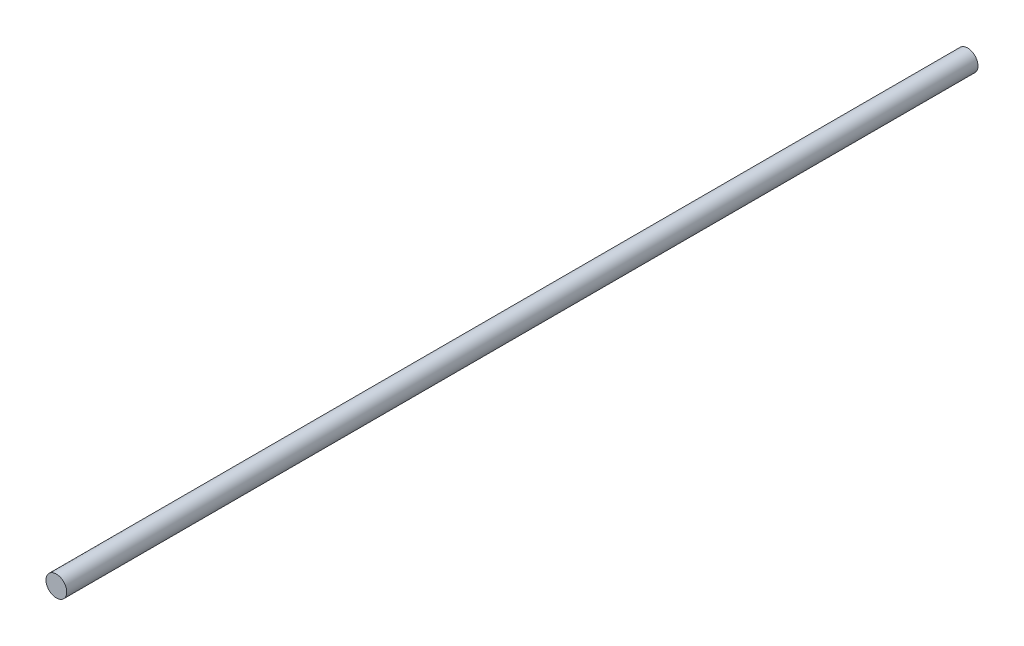
ISO-10303-21;
HEADER;
FILE_DESCRIPTION(('STEP AP214'),'2;1');
FILE_NAME('part.step','',(''),(''),'','','');
FILE_SCHEMA(('AUTOMOTIVE_DESIGN { 1 0 10303 214 1 1 1 1 }'));
ENDSEC;
DATA;
#1=APPLICATION_CONTEXT('core data for automotive mechanical design processes');
#2=APPLICATION_PROTOCOL_DEFINITION('international standard','automotive_design',2000,#1);
#3=PRODUCT_CONTEXT('',#1,'mechanical');
#4=PRODUCT('Part','Part','',(#3));
#5=PRODUCT_RELATED_PRODUCT_CATEGORY('part','',(#4));
#6=PRODUCT_DEFINITION_FORMATION('','',#4);
#7=PRODUCT_DEFINITION_CONTEXT('part definition',#1,'design');
#8=PRODUCT_DEFINITION('design','',#6,#7);
#9=PRODUCT_DEFINITION_SHAPE('','',#8);
#10=(LENGTH_UNIT() NAMED_UNIT(*) SI_UNIT(.MILLI.,.METRE.));
#11=(NAMED_UNIT(*) PLANE_ANGLE_UNIT() SI_UNIT($,.RADIAN.));
#12=(NAMED_UNIT(*) SI_UNIT($,.STERADIAN.) SOLID_ANGLE_UNIT());
#13=UNCERTAINTY_MEASURE_WITH_UNIT(LENGTH_MEASURE(1.E-05),#10,'distance_accuracy_value','');
#14=(GEOMETRIC_REPRESENTATION_CONTEXT(3) GLOBAL_UNCERTAINTY_ASSIGNED_CONTEXT((#13)) GLOBAL_UNIT_ASSIGNED_CONTEXT((#10,
#11,#12)) REPRESENTATION_CONTEXT('',''));
#15=CARTESIAN_POINT('',(0.,0.,0.));
#16=DIRECTION('',(0.,0.,1.));
#17=DIRECTION('',(1.,0.,0.));
#18=AXIS2_PLACEMENT_3D('',#15,#16,#17);
#19=CARTESIAN_POINT('',(0.,0.,180.));
#20=DIRECTION('',(0.,0.,-1.));
#21=DIRECTION('',(-1.,0.,0.));
#22=AXIS2_PLACEMENT_3D('',#19,#20,#21);
#23=CYLINDRICAL_SURFACE('',#22,2.05197183267079);
#24=CARTESIAN_POINT('',(0.,0.,180.));
#25=DIRECTION('',(0.,0.,1.));
#26=DIRECTION('',(1.,0.,0.));
#27=AXIS2_PLACEMENT_3D('',#24,#25,#26);
#28=CIRCLE('',#27,2.05197183267079);
#29=CARTESIAN_POINT('',(2.05197183267079,0.,180.));
#30=VERTEX_POINT('',#29);
#31=EDGE_CURVE('E10',#30,#30,#28,.T.);
#32=ORIENTED_EDGE('',*,*,#31,.F.);
#33=EDGE_LOOP('',(#32));
#34=FACE_BOUND('',#33,.T.);
#35=CARTESIAN_POINT('',(0.,0.,0.));
#36=DIRECTION('',(0.,0.,1.));
#37=DIRECTION('',(1.,0.,0.));
#38=AXIS2_PLACEMENT_3D('',#35,#36,#37);
#39=CIRCLE('',#38,2.05197183267079);
#40=CARTESIAN_POINT('',(2.05197183267079,0.,0.));
#41=VERTEX_POINT('',#40);
#42=EDGE_CURVE('E40',#41,#41,#39,.T.);
#43=ORIENTED_EDGE('',*,*,#42,.T.);
#44=EDGE_LOOP('',(#43));
#45=FACE_BOUND('',#44,.T.);
#46=ADVANCED_FACE('F37',(#34,#45),#23,.T.);
#47=CARTESIAN_POINT('',(0.,0.,180.));
#48=DIRECTION('',(0.,0.,1.));
#49=DIRECTION('',(1.,0.,0.));
#50=AXIS2_PLACEMENT_3D('',#47,#48,#49);
#51=PLANE('',#50);
#52=ORIENTED_EDGE('',*,*,#31,.T.);
#53=EDGE_LOOP('',(#52));
#54=FACE_BOUND('',#53,.T.);
#55=ADVANCED_FACE('F54',(#54),#51,.T.);
#56=CARTESIAN_POINT('',(0.,0.,0.));
#57=DIRECTION('',(0.,0.,1.));
#58=DIRECTION('',(1.,0.,0.));
#59=AXIS2_PLACEMENT_3D('',#56,#57,#58);
#60=PLANE('',#59);
#61=ORIENTED_EDGE('',*,*,#42,.F.);
#62=EDGE_LOOP('',(#61));
#63=FACE_BOUND('',#62,.T.);
#64=ADVANCED_FACE('F52',(#63),#60,.F.);
#65=CLOSED_SHELL('',(#46,#55,#64));
#66=MANIFOLD_SOLID_BREP('B2',#65);
#67=ADVANCED_BREP_SHAPE_REPRESENTATION('',(#18,#66),#14);
#68=SHAPE_DEFINITION_REPRESENTATION(#9,#67);
ENDSEC;
END-ISO-10303-21;
